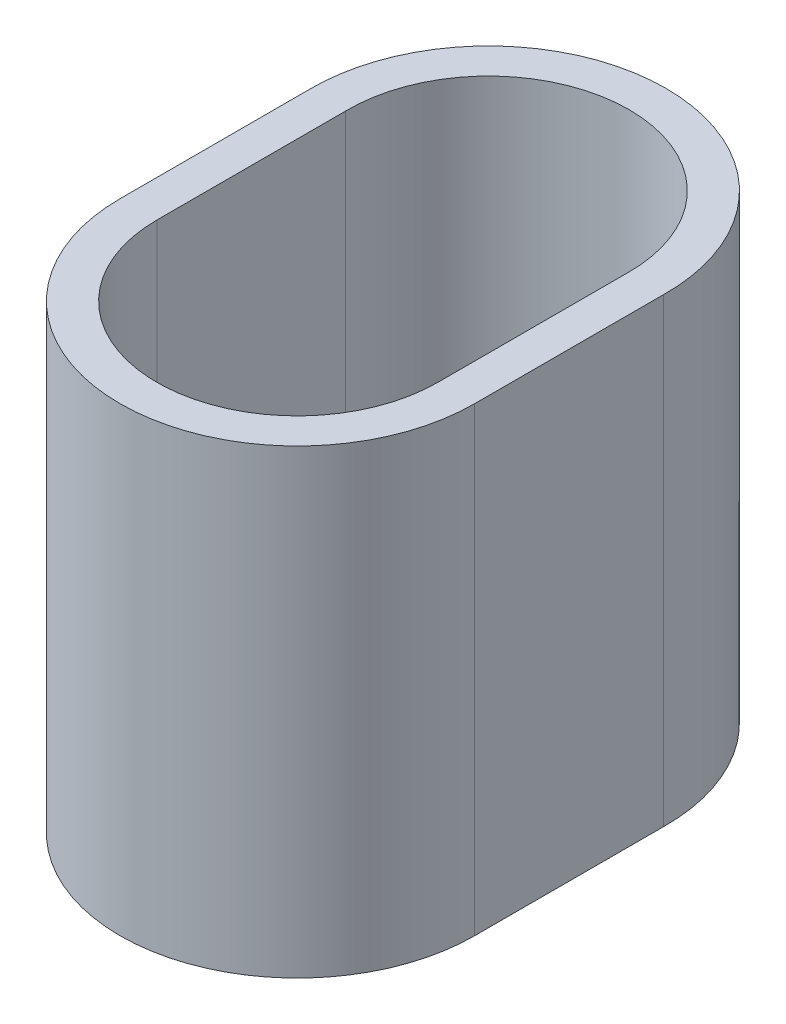
ISO-10303-21;
HEADER;
FILE_DESCRIPTION(('STEP AP214'),'2;1');
FILE_NAME('part.step','',(''),(''),'','','');
FILE_SCHEMA(('AUTOMOTIVE_DESIGN { 1 0 10303 214 1 1 1 1 }'));
ENDSEC;
DATA;
#1=APPLICATION_CONTEXT('core data for automotive mechanical design processes');
#2=APPLICATION_PROTOCOL_DEFINITION('international standard','automotive_design',2000,#1);
#3=PRODUCT_CONTEXT('',#1,'mechanical');
#4=PRODUCT('Part','Part','',(#3));
#5=PRODUCT_RELATED_PRODUCT_CATEGORY('part','',(#4));
#6=PRODUCT_DEFINITION_FORMATION('','',#4);
#7=PRODUCT_DEFINITION_CONTEXT('part definition',#1,'design');
#8=PRODUCT_DEFINITION('design','',#6,#7);
#9=PRODUCT_DEFINITION_SHAPE('','',#8);
#10=(LENGTH_UNIT() NAMED_UNIT(*) SI_UNIT(.MILLI.,.METRE.));
#11=(NAMED_UNIT(*) PLANE_ANGLE_UNIT() SI_UNIT($,.RADIAN.));
#12=(NAMED_UNIT(*) SI_UNIT($,.STERADIAN.) SOLID_ANGLE_UNIT());
#13=UNCERTAINTY_MEASURE_WITH_UNIT(LENGTH_MEASURE(1.E-05),#10,'distance_accuracy_value','');
#14=(GEOMETRIC_REPRESENTATION_CONTEXT(3) GLOBAL_UNCERTAINTY_ASSIGNED_CONTEXT((#13)) GLOBAL_UNIT_ASSIGNED_CONTEXT((#10,
#11,#12)) REPRESENTATION_CONTEXT('',''));
#15=CARTESIAN_POINT('',(0.,0.,0.));
#16=DIRECTION('',(0.,0.,1.));
#17=DIRECTION('',(1.,0.,0.));
#18=AXIS2_PLACEMENT_3D('',#15,#16,#17);
#19=CARTESIAN_POINT('',(-0.752173913043483,50.,9.99999999999999));
#20=DIRECTION('',(0.,1.,0.));
#21=DIRECTION('',(0.,0.,1.));
#22=AXIS2_PLACEMENT_3D('',#19,#20,#21);
#23=PLANE('',#22);
#24=CARTESIAN_POINT('',(-0.752173913043483,50.,9.99999999999999));
#25=DIRECTION('',(0.,1.,0.));
#26=DIRECTION('',(0.,0.,1.));
#27=AXIS2_PLACEMENT_3D('',#24,#25,#26);
#28=CIRCLE('',#27,19.25);
#29=CARTESIAN_POINT('',(-20.0021739130435,50.,9.99999999999999));
#30=VERTEX_POINT('',#29);
#31=CARTESIAN_POINT('',(18.4978260869565,50.,9.99999999999999));
#32=VERTEX_POINT('',#31);
#33=EDGE_CURVE('E138',#30,#32,#28,.T.);
#34=ORIENTED_EDGE('',*,*,#33,.T.);
#35=DIRECTION('',(0.,0.,-1.));
#36=VECTOR('',#35,1.);
#37=CARTESIAN_POINT('',(18.4978260869565,50.,9.99999999999999));
#38=LINE('',#37,#36);
#39=CARTESIAN_POINT('',(18.4978260869565,50.,-10.469122194972));
#40=VERTEX_POINT('',#39);
#41=EDGE_CURVE('E141',#32,#40,#38,.T.);
#42=ORIENTED_EDGE('',*,*,#41,.T.);
#43=CARTESIAN_POINT('',(-0.752173913043484,50.,-10.75));
#44=DIRECTION('',(0.,1.,0.));
#45=DIRECTION('',(0.,0.,1.));
#46=AXIS2_PLACEMENT_3D('',#43,#44,#45);
#47=CIRCLE('',#46,19.2520490426696);
#48=CARTESIAN_POINT('',(-20.0021739130435,50.,-10.4691221949722));
#49=VERTEX_POINT('',#48);
#50=EDGE_CURVE('E144',#40,#49,#47,.T.);
#51=ORIENTED_EDGE('',*,*,#50,.T.);
#52=DIRECTION('',(0.,0.,1.));
#53=VECTOR('',#52,1.);
#54=CARTESIAN_POINT('',(-20.0021739130435,50.,9.99999999999999));
#55=LINE('',#54,#53);
#56=EDGE_CURVE('E146',#49,#30,#55,.T.);
#57=ORIENTED_EDGE('',*,*,#56,.T.);
#58=EDGE_LOOP('',(#34,#42,#51,#57));
#59=FACE_BOUND('',#58,.T.);
#60=DIRECTION('',(0.,0.,1.));
#61=VECTOR('',#60,1.);
#62=CARTESIAN_POINT('',(-16.0021739130435,50.,9.99999999999999));
#63=LINE('',#62,#61);
#64=CARTESIAN_POINT('',(-16.0021739130435,50.,-10.5));
#65=VERTEX_POINT('',#64);
#66=CARTESIAN_POINT('',(-16.0021739130435,50.,9.99999999999999));
#67=VERTEX_POINT('',#66);
#68=EDGE_CURVE('E110',#65,#67,#63,.T.);
#69=ORIENTED_EDGE('',*,*,#68,.F.);
#70=CARTESIAN_POINT('',(-0.752173913043484,50.,-10.75));
#71=DIRECTION('',(0.,1.,0.));
#72=DIRECTION('',(0.,0.,1.));
#73=AXIS2_PLACEMENT_3D('',#70,#71,#72);
#74=CIRCLE('',#73,15.2520490426696);
#75=CARTESIAN_POINT('',(14.4978260869565,50.,-10.5));
#76=VERTEX_POINT('',#75);
#77=EDGE_CURVE('E102',#76,#65,#74,.T.);
#78=ORIENTED_EDGE('',*,*,#77,.F.);
#79=DIRECTION('',(0.,0.,-1.));
#80=VECTOR('',#79,1.);
#81=CARTESIAN_POINT('',(14.4978260869565,50.,9.99999999999999));
#82=LINE('',#81,#80);
#83=CARTESIAN_POINT('',(14.4978260869565,50.,9.99999999999999));
#84=VERTEX_POINT('',#83);
#85=EDGE_CURVE('E124',#84,#76,#82,.T.);
#86=ORIENTED_EDGE('',*,*,#85,.F.);
#87=CARTESIAN_POINT('',(-0.752173913043483,50.,9.99999999999999));
#88=DIRECTION('',(0.,1.,0.));
#89=DIRECTION('',(0.,0.,1.));
#90=AXIS2_PLACEMENT_3D('',#87,#88,#89);
#91=CIRCLE('',#90,15.25);
#92=EDGE_CURVE('E122',#67,#84,#91,.T.);
#93=ORIENTED_EDGE('',*,*,#92,.F.);
#94=EDGE_LOOP('',(#69,#78,#86,#93));
#95=FACE_BOUND('',#94,.T.);
#96=ADVANCED_FACE('F37',(#59,#95),#23,.T.);
#97=CARTESIAN_POINT('',(-0.752173913043483,0.,9.99999999999999));
#98=DIRECTION('',(0.,1.,0.));
#99=DIRECTION('',(0.,0.,1.));
#100=AXIS2_PLACEMENT_3D('',#97,#98,#99);
#101=PLANE('',#100);
#102=CARTESIAN_POINT('',(-0.752173913043483,0.,9.99999999999999));
#103=DIRECTION('',(0.,1.,0.));
#104=DIRECTION('',(0.,0.,1.));
#105=AXIS2_PLACEMENT_3D('',#102,#103,#104);
#106=CIRCLE('',#105,19.25);
#107=CARTESIAN_POINT('',(-20.0021739130435,0.,9.99999999999999));
#108=VERTEX_POINT('',#107);
#109=CARTESIAN_POINT('',(18.4978260869565,0.,9.99999999999999));
#110=VERTEX_POINT('',#109);
#111=EDGE_CURVE('E118',#108,#110,#106,.T.);
#112=ORIENTED_EDGE('',*,*,#111,.F.);
#113=DIRECTION('',(0.,0.,1.));
#114=VECTOR('',#113,1.);
#115=CARTESIAN_POINT('',(-20.0021739130435,0.,9.99999999999999));
#116=LINE('',#115,#114);
#117=CARTESIAN_POINT('',(-20.0021739130435,0.,-10.4691221949722));
#118=VERTEX_POINT('',#117);
#119=EDGE_CURVE('E142',#118,#108,#116,.T.);
#120=ORIENTED_EDGE('',*,*,#119,.F.);
#121=CARTESIAN_POINT('',(-0.752173913043484,0.,-10.75));
#122=DIRECTION('',(0.,1.,0.));
#123=DIRECTION('',(0.,0.,1.));
#124=AXIS2_PLACEMENT_3D('',#121,#122,#123);
#125=CIRCLE('',#124,19.2520490426696);
#126=CARTESIAN_POINT('',(18.4978260869565,0.,-10.469122194972));
#127=VERTEX_POINT('',#126);
#128=EDGE_CURVE('E153',#127,#118,#125,.T.);
#129=ORIENTED_EDGE('',*,*,#128,.F.);
#130=DIRECTION('',(0.,0.,-1.));
#131=VECTOR('',#130,1.);
#132=CARTESIAN_POINT('',(18.4978260869565,0.,9.99999999999999));
#133=LINE('',#132,#131);
#134=EDGE_CURVE('E151',#110,#127,#133,.T.);
#135=ORIENTED_EDGE('',*,*,#134,.F.);
#136=EDGE_LOOP('',(#112,#120,#129,#135));
#137=FACE_BOUND('',#136,.T.);
#138=CARTESIAN_POINT('',(-0.752173913043484,0.,-10.75));
#139=DIRECTION('',(0.,1.,0.));
#140=DIRECTION('',(0.,0.,1.));
#141=AXIS2_PLACEMENT_3D('',#138,#139,#140);
#142=CIRCLE('',#141,15.2520490426696);
#143=CARTESIAN_POINT('',(14.4978260869565,0.,-10.5));
#144=VERTEX_POINT('',#143);
#145=CARTESIAN_POINT('',(-16.0021739130435,0.,-10.5));
#146=VERTEX_POINT('',#145);
#147=EDGE_CURVE('E60',#144,#146,#142,.T.);
#148=ORIENTED_EDGE('',*,*,#147,.T.);
#149=DIRECTION('',(0.,0.,1.));
#150=VECTOR('',#149,1.);
#151=CARTESIAN_POINT('',(-16.0021739130435,0.,9.99999999999999));
#152=LINE('',#151,#150);
#153=CARTESIAN_POINT('',(-16.0021739130435,0.,9.99999999999999));
#154=VERTEX_POINT('',#153);
#155=EDGE_CURVE('E117',#146,#154,#152,.T.);
#156=ORIENTED_EDGE('',*,*,#155,.T.);
#157=CARTESIAN_POINT('',(-0.752173913043483,0.,9.99999999999999));
#158=DIRECTION('',(0.,1.,0.));
#159=DIRECTION('',(0.,0.,1.));
#160=AXIS2_PLACEMENT_3D('',#157,#158,#159);
#161=CIRCLE('',#160,15.25);
#162=CARTESIAN_POINT('',(14.4978260869565,0.,9.99999999999999));
#163=VERTEX_POINT('',#162);
#164=EDGE_CURVE('E130',#154,#163,#161,.T.);
#165=ORIENTED_EDGE('',*,*,#164,.T.);
#166=DIRECTION('',(0.,0.,-1.));
#167=VECTOR('',#166,1.);
#168=CARTESIAN_POINT('',(14.4978260869565,0.,9.99999999999999));
#169=LINE('',#168,#167);
#170=EDGE_CURVE('E111',#163,#144,#169,.T.);
#171=ORIENTED_EDGE('',*,*,#170,.T.);
#172=EDGE_LOOP('',(#148,#156,#165,#171));
#173=FACE_BOUND('',#172,.T.);
#174=ADVANCED_FACE('F171',(#137,#173),#101,.F.);
#175=CARTESIAN_POINT('',(-0.752173913043483,50.,9.99999999999999));
#176=DIRECTION('',(0.,-1.,0.));
#177=DIRECTION('',(0.,0.,-1.));
#178=AXIS2_PLACEMENT_3D('',#175,#176,#177);
#179=CYLINDRICAL_SURFACE('',#178,19.25);
#180=ORIENTED_EDGE('',*,*,#111,.T.);
#181=DIRECTION('',(0.,-1.,0.));
#182=VECTOR('',#181,1.);
#183=CARTESIAN_POINT('',(18.4978260869565,50.,9.99999999999999));
#184=LINE('',#183,#182);
#185=EDGE_CURVE('E11',#32,#110,#184,.T.);
#186=ORIENTED_EDGE('',*,*,#185,.F.);
#187=ORIENTED_EDGE('',*,*,#33,.F.);
#188=DIRECTION('',(0.,-1.,0.));
#189=VECTOR('',#188,1.);
#190=CARTESIAN_POINT('',(-20.0021739130435,50.,9.99999999999999));
#191=LINE('',#190,#189);
#192=EDGE_CURVE('E148',#30,#108,#191,.T.);
#193=ORIENTED_EDGE('',*,*,#192,.T.);
#194=EDGE_LOOP('',(#180,#186,#187,#193));
#195=FACE_BOUND('',#194,.T.);
#196=ADVANCED_FACE('F39',(#195),#179,.T.);
#197=CARTESIAN_POINT('',(18.4978260869565,50.,9.99999999999999));
#198=DIRECTION('',(-1.,0.,0.));
#199=DIRECTION('',(0.,0.,1.));
#200=AXIS2_PLACEMENT_3D('',#197,#198,#199);
#201=PLANE('',#200);
#202=ORIENTED_EDGE('',*,*,#134,.T.);
#203=DIRECTION('',(0.,-1.,0.));
#204=VECTOR('',#203,1.);
#205=CARTESIAN_POINT('',(18.4978260869565,50.,-10.469122194972));
#206=LINE('',#205,#204);
#207=EDGE_CURVE('E45',#40,#127,#206,.T.);
#208=ORIENTED_EDGE('',*,*,#207,.F.);
#209=ORIENTED_EDGE('',*,*,#41,.F.);
#210=ORIENTED_EDGE('',*,*,#185,.T.);
#211=EDGE_LOOP('',(#202,#208,#209,#210));
#212=FACE_BOUND('',#211,.T.);
#213=ADVANCED_FACE('F181',(#212),#201,.F.);
#214=CARTESIAN_POINT('',(-0.752173913043484,50.,-10.75));
#215=DIRECTION('',(0.,-1.,0.));
#216=DIRECTION('',(0.,0.,-1.));
#217=AXIS2_PLACEMENT_3D('',#214,#215,#216);
#218=CYLINDRICAL_SURFACE('',#217,19.2520490426696);
#219=ORIENTED_EDGE('',*,*,#128,.T.);
#220=DIRECTION('',(0.,-1.,0.));
#221=VECTOR('',#220,1.);
#222=CARTESIAN_POINT('',(-20.0021739130435,50.,-10.4691221949722));
#223=LINE('',#222,#221);
#224=EDGE_CURVE('E158',#49,#118,#223,.T.);
#225=ORIENTED_EDGE('',*,*,#224,.F.);
#226=ORIENTED_EDGE('',*,*,#50,.F.);
#227=ORIENTED_EDGE('',*,*,#207,.T.);
#228=EDGE_LOOP('',(#219,#225,#226,#227));
#229=FACE_BOUND('',#228,.T.);
#230=ADVANCED_FACE('F165',(#229),#218,.T.);
#231=CARTESIAN_POINT('',(-20.0021739130435,50.,9.99999999999999));
#232=DIRECTION('',(1.,0.,0.));
#233=DIRECTION('',(0.,0.,-1.));
#234=AXIS2_PLACEMENT_3D('',#231,#232,#233);
#235=PLANE('',#234);
#236=ORIENTED_EDGE('',*,*,#119,.T.);
#237=ORIENTED_EDGE('',*,*,#192,.F.);
#238=ORIENTED_EDGE('',*,*,#56,.F.);
#239=ORIENTED_EDGE('',*,*,#224,.T.);
#240=EDGE_LOOP('',(#236,#237,#238,#239));
#241=FACE_BOUND('',#240,.T.);
#242=ADVANCED_FACE('F175',(#241),#235,.F.);
#243=CARTESIAN_POINT('',(-0.752173913043484,50.,-10.75));
#244=DIRECTION('',(0.,-1.,0.));
#245=DIRECTION('',(0.,0.,-1.));
#246=AXIS2_PLACEMENT_3D('',#243,#244,#245);
#247=CYLINDRICAL_SURFACE('',#246,15.2520490426696);
#248=ORIENTED_EDGE('',*,*,#147,.F.);
#249=DIRECTION('',(0.,-1.,0.));
#250=VECTOR('',#249,1.);
#251=CARTESIAN_POINT('',(14.4978260869565,50.,-10.5));
#252=LINE('',#251,#250);
#253=EDGE_CURVE('E106',#76,#144,#252,.T.);
#254=ORIENTED_EDGE('',*,*,#253,.F.);
#255=ORIENTED_EDGE('',*,*,#77,.T.);
#256=DIRECTION('',(0.,-1.,0.));
#257=VECTOR('',#256,1.);
#258=CARTESIAN_POINT('',(-16.0021739130435,50.,-10.5));
#259=LINE('',#258,#257);
#260=EDGE_CURVE('E105',#65,#146,#259,.T.);
#261=ORIENTED_EDGE('',*,*,#260,.T.);
#262=EDGE_LOOP('',(#248,#254,#255,#261));
#263=FACE_BOUND('',#262,.T.);
#264=ADVANCED_FACE('F104',(#263),#247,.F.);
#265=CARTESIAN_POINT('',(-16.0021739130435,50.,9.99999999999999));
#266=DIRECTION('',(1.,0.,0.));
#267=DIRECTION('',(0.,0.,-1.));
#268=AXIS2_PLACEMENT_3D('',#265,#266,#267);
#269=PLANE('',#268);
#270=ORIENTED_EDGE('',*,*,#155,.F.);
#271=ORIENTED_EDGE('',*,*,#260,.F.);
#272=ORIENTED_EDGE('',*,*,#68,.T.);
#273=DIRECTION('',(0.,-1.,0.));
#274=VECTOR('',#273,1.);
#275=CARTESIAN_POINT('',(-16.0021739130435,50.,9.99999999999999));
#276=LINE('',#275,#274);
#277=EDGE_CURVE('E119',#67,#154,#276,.T.);
#278=ORIENTED_EDGE('',*,*,#277,.T.);
#279=EDGE_LOOP('',(#270,#271,#272,#278));
#280=FACE_BOUND('',#279,.T.);
#281=ADVANCED_FACE('F114',(#280),#269,.T.);
#282=CARTESIAN_POINT('',(-0.752173913043483,50.,9.99999999999999));
#283=DIRECTION('',(0.,-1.,0.));
#284=DIRECTION('',(0.,0.,-1.));
#285=AXIS2_PLACEMENT_3D('',#282,#283,#284);
#286=CYLINDRICAL_SURFACE('',#285,15.25);
#287=ORIENTED_EDGE('',*,*,#164,.F.);
#288=ORIENTED_EDGE('',*,*,#277,.F.);
#289=ORIENTED_EDGE('',*,*,#92,.T.);
#290=DIRECTION('',(0.,-1.,0.));
#291=VECTOR('',#290,1.);
#292=CARTESIAN_POINT('',(14.4978260869565,50.,9.99999999999999));
#293=LINE('',#292,#291);
#294=EDGE_CURVE('E52',#84,#163,#293,.T.);
#295=ORIENTED_EDGE('',*,*,#294,.T.);
#296=EDGE_LOOP('',(#287,#288,#289,#295));
#297=FACE_BOUND('',#296,.T.);
#298=ADVANCED_FACE('F204',(#297),#286,.F.);
#299=CARTESIAN_POINT('',(14.4978260869565,50.,9.99999999999999));
#300=DIRECTION('',(-1.,0.,0.));
#301=DIRECTION('',(0.,0.,1.));
#302=AXIS2_PLACEMENT_3D('',#299,#300,#301);
#303=PLANE('',#302);
#304=ORIENTED_EDGE('',*,*,#170,.F.);
#305=ORIENTED_EDGE('',*,*,#294,.F.);
#306=ORIENTED_EDGE('',*,*,#85,.T.);
#307=ORIENTED_EDGE('',*,*,#253,.T.);
#308=EDGE_LOOP('',(#304,#305,#306,#307));
#309=FACE_BOUND('',#308,.T.);
#310=ADVANCED_FACE('F208',(#309),#303,.T.);
#311=CLOSED_SHELL('',(#96,#174,#196,#213,#230,#242,#264,#281,#298,#310));
#312=MANIFOLD_SOLID_BREP('B2',#311);
#313=ADVANCED_BREP_SHAPE_REPRESENTATION('',(#18,#312),#14);
#314=SHAPE_DEFINITION_REPRESENTATION(#9,#313);
ENDSEC;
END-ISO-10303-21;
